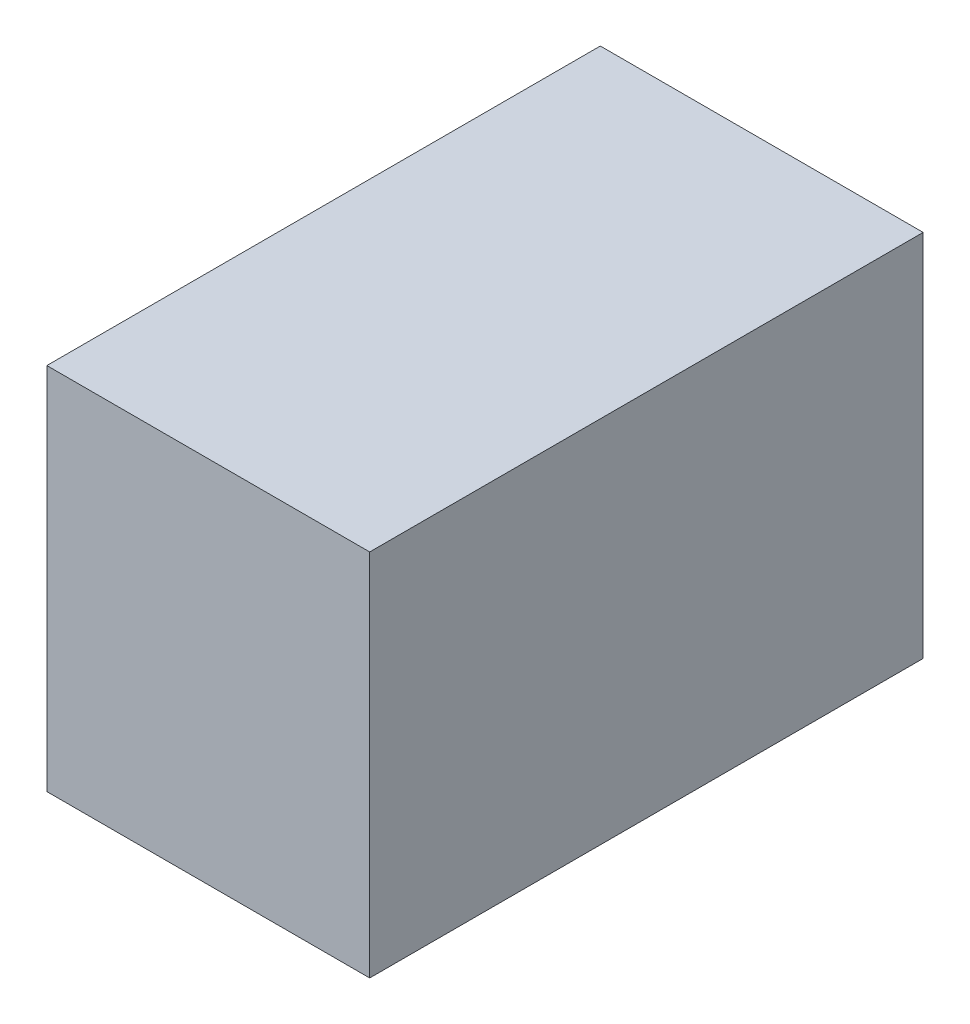
ISO-10303-21;
HEADER;
FILE_DESCRIPTION(('STEP AP214'),'2;1');
FILE_NAME('part.step','',(''),(''),'','','');
FILE_SCHEMA(('AUTOMOTIVE_DESIGN { 1 0 10303 214 1 1 1 1 }'));
ENDSEC;
DATA;
#1=APPLICATION_CONTEXT('core data for automotive mechanical design processes');
#2=APPLICATION_PROTOCOL_DEFINITION('international standard','automotive_design',2000,#1);
#3=PRODUCT_CONTEXT('',#1,'mechanical');
#4=PRODUCT('Part','Part','',(#3));
#5=PRODUCT_RELATED_PRODUCT_CATEGORY('part','',(#4));
#6=PRODUCT_DEFINITION_FORMATION('','',#4);
#7=PRODUCT_DEFINITION_CONTEXT('part definition',#1,'design');
#8=PRODUCT_DEFINITION('design','',#6,#7);
#9=PRODUCT_DEFINITION_SHAPE('','',#8);
#10=(LENGTH_UNIT() NAMED_UNIT(*) SI_UNIT(.MILLI.,.METRE.));
#11=(NAMED_UNIT(*) PLANE_ANGLE_UNIT() SI_UNIT($,.RADIAN.));
#12=(NAMED_UNIT(*) SI_UNIT($,.STERADIAN.) SOLID_ANGLE_UNIT());
#13=UNCERTAINTY_MEASURE_WITH_UNIT(LENGTH_MEASURE(1.E-05),#10,'distance_accuracy_value','');
#14=(GEOMETRIC_REPRESENTATION_CONTEXT(3) GLOBAL_UNCERTAINTY_ASSIGNED_CONTEXT((#13)) GLOBAL_UNIT_ASSIGNED_CONTEXT((#10,
#11,#12)) REPRESENTATION_CONTEXT('',''));
#15=CARTESIAN_POINT('',(0.,0.,0.));
#16=DIRECTION('',(0.,0.,1.));
#17=DIRECTION('',(1.,0.,0.));
#18=AXIS2_PLACEMENT_3D('',#15,#16,#17);
#19=CARTESIAN_POINT('',(0.,0.,60.));
#20=DIRECTION('',(1.,0.,0.));
#21=DIRECTION('',(0.,0.,-1.));
#22=AXIS2_PLACEMENT_3D('',#19,#20,#21);
#23=PLANE('',#22);
#24=DIRECTION('',(0.,-1.,0.));
#25=VECTOR('',#24,1.);
#26=CARTESIAN_POINT('',(0.,0.,0.));
#27=LINE('',#26,#25);
#28=CARTESIAN_POINT('',(0.,40.,0.));
#29=VERTEX_POINT('',#28);
#30=CARTESIAN_POINT('',(0.,0.,0.));
#31=VERTEX_POINT('',#30);
#32=EDGE_CURVE('E107',#29,#31,#27,.T.);
#33=ORIENTED_EDGE('',*,*,#32,.T.);
#34=DIRECTION('',(0.,0.,-1.));
#35=VECTOR('',#34,1.);
#36=CARTESIAN_POINT('',(0.,0.,60.));
#37=LINE('',#36,#35);
#38=CARTESIAN_POINT('',(0.,0.,60.));
#39=VERTEX_POINT('',#38);
#40=EDGE_CURVE('E11',#39,#31,#37,.T.);
#41=ORIENTED_EDGE('',*,*,#40,.F.);
#42=DIRECTION('',(0.,-1.,0.));
#43=VECTOR('',#42,1.);
#44=CARTESIAN_POINT('',(0.,0.,60.));
#45=LINE('',#44,#43);
#46=CARTESIAN_POINT('',(0.,40.,60.));
#47=VERTEX_POINT('',#46);
#48=EDGE_CURVE('E91',#47,#39,#45,.T.);
#49=ORIENTED_EDGE('',*,*,#48,.F.);
#50=DIRECTION('',(0.,0.,-1.));
#51=VECTOR('',#50,1.);
#52=CARTESIAN_POINT('',(0.,40.,60.));
#53=LINE('',#52,#51);
#54=EDGE_CURVE('E103',#47,#29,#53,.T.);
#55=ORIENTED_EDGE('',*,*,#54,.T.);
#56=EDGE_LOOP('',(#33,#41,#49,#55));
#57=FACE_BOUND('',#56,.T.);
#58=ADVANCED_FACE('F39',(#57),#23,.F.);
#59=CARTESIAN_POINT('',(0.,0.,60.));
#60=DIRECTION('',(0.,1.,0.));
#61=DIRECTION('',(-1.,0.,0.));
#62=AXIS2_PLACEMENT_3D('',#59,#60,#61);
#63=PLANE('',#62);
#64=DIRECTION('',(1.,0.,0.));
#65=VECTOR('',#64,1.);
#66=CARTESIAN_POINT('',(0.,0.,0.));
#67=LINE('',#66,#65);
#68=CARTESIAN_POINT('',(35.,0.,0.));
#69=VERTEX_POINT('',#68);
#70=EDGE_CURVE('E96',#31,#69,#67,.T.);
#71=ORIENTED_EDGE('',*,*,#70,.T.);
#72=DIRECTION('',(0.,0.,-1.));
#73=VECTOR('',#72,1.);
#74=CARTESIAN_POINT('',(35.,0.,60.));
#75=LINE('',#74,#73);
#76=CARTESIAN_POINT('',(35.,0.,60.));
#77=VERTEX_POINT('',#76);
#78=EDGE_CURVE('E48',#77,#69,#75,.T.);
#79=ORIENTED_EDGE('',*,*,#78,.F.);
#80=DIRECTION('',(1.,0.,0.));
#81=VECTOR('',#80,1.);
#82=CARTESIAN_POINT('',(0.,0.,60.));
#83=LINE('',#82,#81);
#84=EDGE_CURVE('E86',#39,#77,#83,.T.);
#85=ORIENTED_EDGE('',*,*,#84,.F.);
#86=ORIENTED_EDGE('',*,*,#40,.T.);
#87=EDGE_LOOP('',(#71,#79,#85,#86));
#88=FACE_BOUND('',#87,.T.);
#89=ADVANCED_FACE('F95',(#88),#63,.F.);
#90=CARTESIAN_POINT('',(35.,0.,60.));
#91=DIRECTION('',(-1.,0.,0.));
#92=DIRECTION('',(0.,-1.,0.));
#93=AXIS2_PLACEMENT_3D('',#90,#91,#92);
#94=PLANE('',#93);
#95=DIRECTION('',(0.,1.,0.));
#96=VECTOR('',#95,1.);
#97=CARTESIAN_POINT('',(35.,0.,0.));
#98=LINE('',#97,#96);
#99=CARTESIAN_POINT('',(35.,40.,0.));
#100=VERTEX_POINT('',#99);
#101=EDGE_CURVE('E73',#69,#100,#98,.T.);
#102=ORIENTED_EDGE('',*,*,#101,.T.);
#103=DIRECTION('',(0.,0.,-1.));
#104=VECTOR('',#103,1.);
#105=CARTESIAN_POINT('',(35.,40.,60.));
#106=LINE('',#105,#104);
#107=CARTESIAN_POINT('',(35.,40.,60.));
#108=VERTEX_POINT('',#107);
#109=EDGE_CURVE('E98',#108,#100,#106,.T.);
#110=ORIENTED_EDGE('',*,*,#109,.F.);
#111=DIRECTION('',(0.,1.,0.));
#112=VECTOR('',#111,1.);
#113=CARTESIAN_POINT('',(35.,0.,60.));
#114=LINE('',#113,#112);
#115=EDGE_CURVE('E89',#77,#108,#114,.T.);
#116=ORIENTED_EDGE('',*,*,#115,.F.);
#117=ORIENTED_EDGE('',*,*,#78,.T.);
#118=EDGE_LOOP('',(#102,#110,#116,#117));
#119=FACE_BOUND('',#118,.T.);
#120=ADVANCED_FACE('F99',(#119),#94,.F.);
#121=CARTESIAN_POINT('',(0.,40.,60.));
#122=DIRECTION('',(0.,-1.,0.));
#123=DIRECTION('',(1.,0.,0.));
#124=AXIS2_PLACEMENT_3D('',#121,#122,#123);
#125=PLANE('',#124);
#126=DIRECTION('',(-1.,0.,0.));
#127=VECTOR('',#126,1.);
#128=CARTESIAN_POINT('',(0.,40.,0.));
#129=LINE('',#128,#127);
#130=EDGE_CURVE('E79',#100,#29,#129,.T.);
#131=ORIENTED_EDGE('',*,*,#130,.T.);
#132=ORIENTED_EDGE('',*,*,#54,.F.);
#133=DIRECTION('',(-1.,0.,0.));
#134=VECTOR('',#133,1.);
#135=CARTESIAN_POINT('',(0.,40.,60.));
#136=LINE('',#135,#134);
#137=EDGE_CURVE('E56',#108,#47,#136,.T.);
#138=ORIENTED_EDGE('',*,*,#137,.F.);
#139=ORIENTED_EDGE('',*,*,#109,.T.);
#140=EDGE_LOOP('',(#131,#132,#138,#139));
#141=FACE_BOUND('',#140,.T.);
#142=ADVANCED_FACE('F120',(#141),#125,.F.);
#143=CARTESIAN_POINT('',(0.,0.,60.));
#144=DIRECTION('',(0.,0.,-1.));
#145=DIRECTION('',(-1.,0.,0.));
#146=AXIS2_PLACEMENT_3D('',#143,#144,#145);
#147=PLANE('',#146);
#148=ORIENTED_EDGE('',*,*,#48,.T.);
#149=ORIENTED_EDGE('',*,*,#84,.T.);
#150=ORIENTED_EDGE('',*,*,#115,.T.);
#151=ORIENTED_EDGE('',*,*,#137,.T.);
#152=EDGE_LOOP('',(#148,#149,#150,#151));
#153=FACE_BOUND('',#152,.T.);
#154=ADVANCED_FACE('F87',(#153),#147,.F.);
#155=CARTESIAN_POINT('',(0.,0.,0.));
#156=DIRECTION('',(0.,0.,-1.));
#157=DIRECTION('',(-1.,0.,0.));
#158=AXIS2_PLACEMENT_3D('',#155,#156,#157);
#159=PLANE('',#158);
#160=ORIENTED_EDGE('',*,*,#32,.F.);
#161=ORIENTED_EDGE('',*,*,#130,.F.);
#162=ORIENTED_EDGE('',*,*,#101,.F.);
#163=ORIENTED_EDGE('',*,*,#70,.F.);
#164=EDGE_LOOP('',(#160,#161,#162,#163));
#165=FACE_BOUND('',#164,.T.);
#166=ADVANCED_FACE('F123',(#165),#159,.T.);
#167=CLOSED_SHELL('',(#58,#89,#120,#142,#154,#166));
#168=MANIFOLD_SOLID_BREP('B2',#167);
#169=ADVANCED_BREP_SHAPE_REPRESENTATION('',(#18,#168),#14);
#170=SHAPE_DEFINITION_REPRESENTATION(#9,#169);
ENDSEC;
END-ISO-10303-21;
